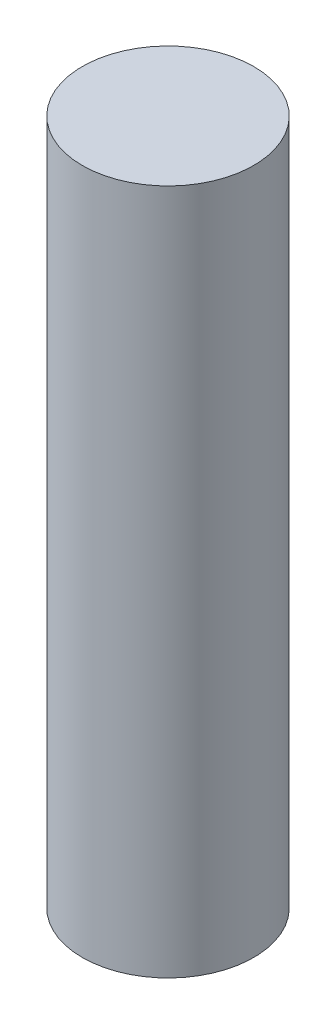
ISO-10303-21;
HEADER;
FILE_DESCRIPTION(('STEP AP214'),'2;1');
FILE_NAME('part.step','',(''),(''),'','','');
FILE_SCHEMA(('AUTOMOTIVE_DESIGN { 1 0 10303 214 1 1 1 1 }'));
ENDSEC;
DATA;
#1=APPLICATION_CONTEXT('core data for automotive mechanical design processes');
#2=APPLICATION_PROTOCOL_DEFINITION('international standard','automotive_design',2000,#1);
#3=PRODUCT_CONTEXT('',#1,'mechanical');
#4=PRODUCT('Part','Part','',(#3));
#5=PRODUCT_RELATED_PRODUCT_CATEGORY('part','',(#4));
#6=PRODUCT_DEFINITION_FORMATION('','',#4);
#7=PRODUCT_DEFINITION_CONTEXT('part definition',#1,'design');
#8=PRODUCT_DEFINITION('design','',#6,#7);
#9=PRODUCT_DEFINITION_SHAPE('','',#8);
#10=(LENGTH_UNIT() NAMED_UNIT(*) SI_UNIT(.MILLI.,.METRE.));
#11=(NAMED_UNIT(*) PLANE_ANGLE_UNIT() SI_UNIT($,.RADIAN.));
#12=(NAMED_UNIT(*) SI_UNIT($,.STERADIAN.) SOLID_ANGLE_UNIT());
#13=UNCERTAINTY_MEASURE_WITH_UNIT(LENGTH_MEASURE(1.E-05),#10,'distance_accuracy_value','');
#14=(GEOMETRIC_REPRESENTATION_CONTEXT(3) GLOBAL_UNCERTAINTY_ASSIGNED_CONTEXT((#13)) GLOBAL_UNIT_ASSIGNED_CONTEXT((#10,
#11,#12)) REPRESENTATION_CONTEXT('',''));
#15=CARTESIAN_POINT('',(0.,0.,0.));
#16=DIRECTION('',(0.,0.,1.));
#17=DIRECTION('',(1.,0.,0.));
#18=AXIS2_PLACEMENT_3D('',#15,#16,#17);
#19=CARTESIAN_POINT('',(0.,60.,0.));
#20=DIRECTION('',(0.,-1.,0.));
#21=DIRECTION('',(0.,0.,-1.));
#22=AXIS2_PLACEMENT_3D('',#19,#20,#21);
#23=CYLINDRICAL_SURFACE('',#22,7.5);
#24=CARTESIAN_POINT('',(0.,60.,0.));
#25=DIRECTION('',(0.,1.,0.));
#26=DIRECTION('',(0.,0.,1.));
#27=AXIS2_PLACEMENT_3D('',#24,#25,#26);
#28=CIRCLE('',#27,7.5);
#29=CARTESIAN_POINT('',(0.,60.,7.5));
#30=VERTEX_POINT('',#29);
#31=EDGE_CURVE('E10',#30,#30,#28,.T.);
#32=ORIENTED_EDGE('',*,*,#31,.F.);
#33=EDGE_LOOP('',(#32));
#34=FACE_BOUND('',#33,.T.);
#35=CARTESIAN_POINT('',(0.,0.,0.));
#36=DIRECTION('',(0.,1.,0.));
#37=DIRECTION('',(0.,0.,1.));
#38=AXIS2_PLACEMENT_3D('',#35,#36,#37);
#39=CIRCLE('',#38,7.5);
#40=CARTESIAN_POINT('',(0.,0.,7.5));
#41=VERTEX_POINT('',#40);
#42=EDGE_CURVE('E46',#41,#41,#39,.T.);
#43=ORIENTED_EDGE('',*,*,#42,.T.);
#44=EDGE_LOOP('',(#43));
#45=FACE_BOUND('',#44,.T.);
#46=ADVANCED_FACE('F43',(#34,#45),#23,.T.);
#47=CARTESIAN_POINT('',(0.,60.,0.));
#48=DIRECTION('',(0.,1.,0.));
#49=DIRECTION('',(0.,0.,1.));
#50=AXIS2_PLACEMENT_3D('',#47,#48,#49);
#51=PLANE('',#50);
#52=ORIENTED_EDGE('',*,*,#31,.T.);
#53=EDGE_LOOP('',(#52));
#54=FACE_BOUND('',#53,.T.);
#55=ADVANCED_FACE('F60',(#54),#51,.T.);
#56=CARTESIAN_POINT('',(0.,0.,0.));
#57=DIRECTION('',(0.,1.,0.));
#58=DIRECTION('',(0.,0.,1.));
#59=AXIS2_PLACEMENT_3D('',#56,#57,#58);
#60=PLANE('',#59);
#61=ORIENTED_EDGE('',*,*,#42,.F.);
#62=EDGE_LOOP('',(#61));
#63=FACE_BOUND('',#62,.T.);
#64=ADVANCED_FACE('F58',(#63),#60,.F.);
#65=CLOSED_SHELL('',(#46,#55,#64));
#66=MANIFOLD_SOLID_BREP('B2',#65);
#67=ADVANCED_BREP_SHAPE_REPRESENTATION('',(#18,#66),#14);
#68=SHAPE_DEFINITION_REPRESENTATION(#9,#67);
ENDSEC;
END-ISO-10303-21;
